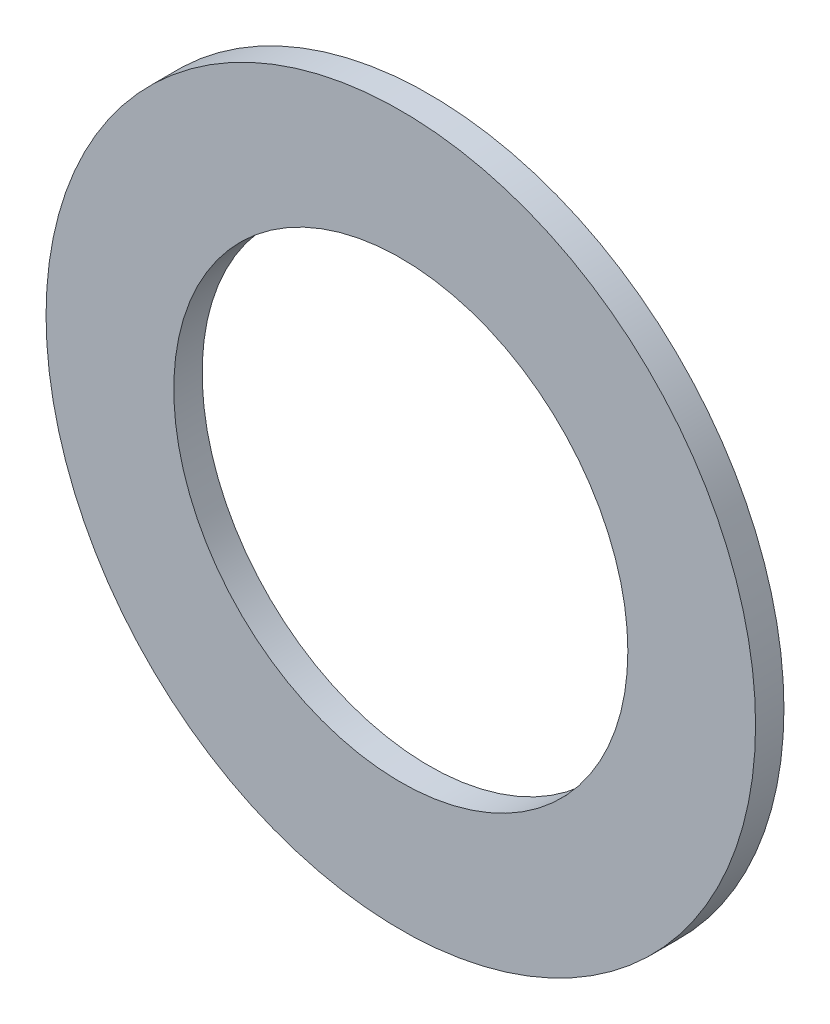
ISO-10303-21;
HEADER;
FILE_DESCRIPTION(('STEP AP214'),'2;1');
FILE_NAME('part.step','',(''),(''),'','','');
FILE_SCHEMA(('AUTOMOTIVE_DESIGN { 1 0 10303 214 1 1 1 1 }'));
ENDSEC;
DATA;
#1=APPLICATION_CONTEXT('core data for automotive mechanical design processes');
#2=APPLICATION_PROTOCOL_DEFINITION('international standard','automotive_design',2000,#1);
#3=PRODUCT_CONTEXT('',#1,'mechanical');
#4=PRODUCT('Part','Part','',(#3));
#5=PRODUCT_RELATED_PRODUCT_CATEGORY('part','',(#4));
#6=PRODUCT_DEFINITION_FORMATION('','',#4);
#7=PRODUCT_DEFINITION_CONTEXT('part definition',#1,'design');
#8=PRODUCT_DEFINITION('design','',#6,#7);
#9=PRODUCT_DEFINITION_SHAPE('','',#8);
#10=(LENGTH_UNIT() NAMED_UNIT(*) SI_UNIT(.MILLI.,.METRE.));
#11=(NAMED_UNIT(*) PLANE_ANGLE_UNIT() SI_UNIT($,.RADIAN.));
#12=(NAMED_UNIT(*) SI_UNIT($,.STERADIAN.) SOLID_ANGLE_UNIT());
#13=UNCERTAINTY_MEASURE_WITH_UNIT(LENGTH_MEASURE(1.E-05),#10,'distance_accuracy_value','');
#14=(GEOMETRIC_REPRESENTATION_CONTEXT(3) GLOBAL_UNCERTAINTY_ASSIGNED_CONTEXT((#13)) GLOBAL_UNIT_ASSIGNED_CONTEXT((#10,
#11,#12)) REPRESENTATION_CONTEXT('',''));
#15=CARTESIAN_POINT('',(0.,0.,0.));
#16=DIRECTION('',(0.,0.,1.));
#17=DIRECTION('',(1.,0.,0.));
#18=AXIS2_PLACEMENT_3D('',#15,#16,#17);
#19=CARTESIAN_POINT('',(0.,0.,-0.254));
#20=DIRECTION('',(0.,0.,1.));
#21=DIRECTION('',(1.,0.,0.));
#22=AXIS2_PLACEMENT_3D('',#19,#20,#21);
#23=CYLINDRICAL_SURFACE('',#22,3.175);
#24=CARTESIAN_POINT('',(0.,0.,-0.254));
#25=DIRECTION('',(0.,0.,1.));
#26=DIRECTION('',(1.,0.,0.));
#27=AXIS2_PLACEMENT_3D('',#24,#25,#26);
#28=CIRCLE('',#27,3.175);
#29=CARTESIAN_POINT('',(3.175,0.,-0.254));
#30=VERTEX_POINT('',#29);
#31=EDGE_CURVE('E10',#30,#30,#28,.T.);
#32=ORIENTED_EDGE('',*,*,#31,.T.);
#33=EDGE_LOOP('',(#32));
#34=FACE_BOUND('',#33,.T.);
#35=CARTESIAN_POINT('',(0.,0.,0.));
#36=DIRECTION('',(0.,0.,1.));
#37=DIRECTION('',(1.,0.,0.));
#38=AXIS2_PLACEMENT_3D('',#35,#36,#37);
#39=CIRCLE('',#38,3.175);
#40=CARTESIAN_POINT('',(3.175,0.,0.));
#41=VERTEX_POINT('',#40);
#42=EDGE_CURVE('E35',#41,#41,#39,.T.);
#43=ORIENTED_EDGE('',*,*,#42,.F.);
#44=EDGE_LOOP('',(#43));
#45=FACE_BOUND('',#44,.T.);
#46=ADVANCED_FACE('F32',(#34,#45),#23,.T.);
#47=CARTESIAN_POINT('',(0.,0.,-0.254));
#48=DIRECTION('',(0.,0.,1.));
#49=DIRECTION('',(1.,0.,0.));
#50=AXIS2_PLACEMENT_3D('',#47,#48,#49);
#51=PLANE('',#50);
#52=CARTESIAN_POINT('',(0.,0.,-0.254));
#53=DIRECTION('',(0.,0.,1.));
#54=DIRECTION('',(1.,0.,0.));
#55=AXIS2_PLACEMENT_3D('',#52,#53,#54);
#56=CIRCLE('',#55,2.032);
#57=CARTESIAN_POINT('',(2.032,0.,-0.254));
#58=VERTEX_POINT('',#57);
#59=EDGE_CURVE('E42',#58,#58,#56,.T.);
#60=ORIENTED_EDGE('',*,*,#59,.T.);
#61=EDGE_LOOP('',(#60));
#62=FACE_BOUND('',#61,.T.);
#63=ORIENTED_EDGE('',*,*,#31,.F.);
#64=EDGE_LOOP('',(#63));
#65=FACE_BOUND('',#64,.T.);
#66=ADVANCED_FACE('F50',(#62,#65),#51,.F.);
#67=CARTESIAN_POINT('',(0.,0.,0.));
#68=DIRECTION('',(0.,0.,1.));
#69=DIRECTION('',(1.,0.,0.));
#70=AXIS2_PLACEMENT_3D('',#67,#68,#69);
#71=PLANE('',#70);
#72=CARTESIAN_POINT('',(0.,0.,0.));
#73=DIRECTION('',(0.,0.,1.));
#74=DIRECTION('',(1.,0.,0.));
#75=AXIS2_PLACEMENT_3D('',#72,#73,#74);
#76=CIRCLE('',#75,2.032);
#77=CARTESIAN_POINT('',(2.032,0.,0.));
#78=VERTEX_POINT('',#77);
#79=EDGE_CURVE('E44',#78,#78,#76,.T.);
#80=ORIENTED_EDGE('',*,*,#79,.F.);
#81=EDGE_LOOP('',(#80));
#82=FACE_BOUND('',#81,.T.);
#83=ORIENTED_EDGE('',*,*,#42,.T.);
#84=EDGE_LOOP('',(#83));
#85=FACE_BOUND('',#84,.T.);
#86=ADVANCED_FACE('F56',(#82,#85),#71,.T.);
#87=CARTESIAN_POINT('',(0.,0.,-0.254));
#88=DIRECTION('',(0.,0.,1.));
#89=DIRECTION('',(1.,0.,0.));
#90=AXIS2_PLACEMENT_3D('',#87,#88,#89);
#91=CYLINDRICAL_SURFACE('',#90,2.032);
#92=ORIENTED_EDGE('',*,*,#59,.F.);
#93=EDGE_LOOP('',(#92));
#94=FACE_BOUND('',#93,.T.);
#95=ORIENTED_EDGE('',*,*,#79,.T.);
#96=EDGE_LOOP('',(#95));
#97=FACE_BOUND('',#96,.T.);
#98=ADVANCED_FACE('F53',(#94,#97),#91,.F.);
#99=CLOSED_SHELL('',(#46,#66,#86,#98));
#100=MANIFOLD_SOLID_BREP('B2',#99);
#101=ADVANCED_BREP_SHAPE_REPRESENTATION('',(#18,#100),#14);
#102=SHAPE_DEFINITION_REPRESENTATION(#9,#101);
ENDSEC;
END-ISO-10303-21;
